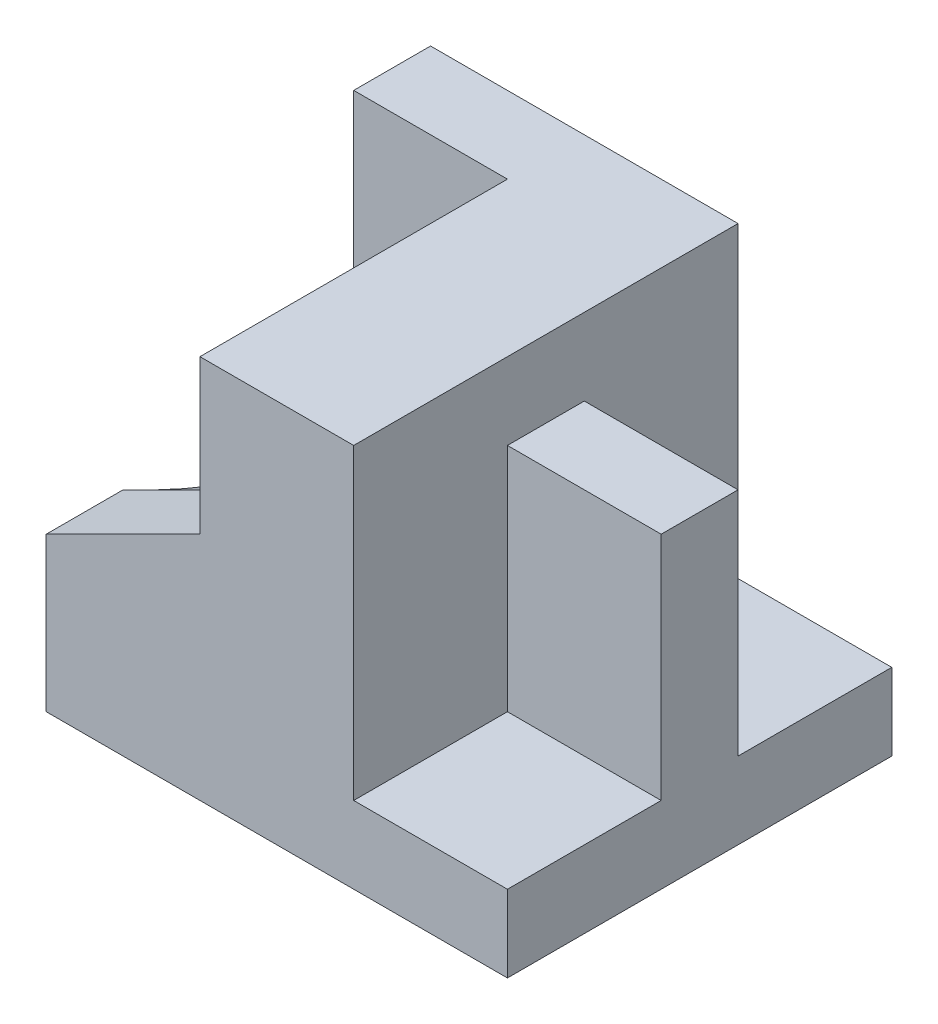
ISO-10303-21;
HEADER;
FILE_DESCRIPTION(('STEP AP214'),'2;1');
FILE_NAME('part.step','',(''),(''),'','','');
FILE_SCHEMA(('AUTOMOTIVE_DESIGN { 1 0 10303 214 1 1 1 1 }'));
ENDSEC;
DATA;
#1=APPLICATION_CONTEXT('core data for automotive mechanical design processes');
#2=APPLICATION_PROTOCOL_DEFINITION('international standard','automotive_design',2000,#1);
#3=PRODUCT_CONTEXT('',#1,'mechanical');
#4=PRODUCT('Part','Part','',(#3));
#5=PRODUCT_RELATED_PRODUCT_CATEGORY('part','',(#4));
#6=PRODUCT_DEFINITION_FORMATION('','',#4);
#7=PRODUCT_DEFINITION_CONTEXT('part definition',#1,'design');
#8=PRODUCT_DEFINITION('design','',#6,#7);
#9=PRODUCT_DEFINITION_SHAPE('','',#8);
#10=(LENGTH_UNIT() NAMED_UNIT(*) SI_UNIT(.MILLI.,.METRE.));
#11=(NAMED_UNIT(*) PLANE_ANGLE_UNIT() SI_UNIT($,.RADIAN.));
#12=(NAMED_UNIT(*) SI_UNIT($,.STERADIAN.) SOLID_ANGLE_UNIT());
#13=UNCERTAINTY_MEASURE_WITH_UNIT(LENGTH_MEASURE(1.E-05),#10,'distance_accuracy_value','');
#14=(GEOMETRIC_REPRESENTATION_CONTEXT(3) GLOBAL_UNCERTAINTY_ASSIGNED_CONTEXT((#13)) GLOBAL_UNIT_ASSIGNED_CONTEXT((#10,
#11,#12)) REPRESENTATION_CONTEXT('',''));
#15=CARTESIAN_POINT('',(0.,0.,0.));
#16=DIRECTION('',(0.,0.,1.));
#17=DIRECTION('',(1.,0.,0.));
#18=AXIS2_PLACEMENT_3D('',#15,#16,#17);
#19=CARTESIAN_POINT('',(0.,0.,5.));
#20=DIRECTION('',(1.,0.,0.));
#21=DIRECTION('',(0.,0.,-1.));
#22=AXIS2_PLACEMENT_3D('',#19,#20,#21);
#23=PLANE('',#22);
#24=DIRECTION('',(0.,-1.,0.));
#25=VECTOR('',#24,1.);
#26=CARTESIAN_POINT('',(0.,0.,0.));
#27=LINE('',#26,#25);
#28=CARTESIAN_POINT('',(0.,5.,0.));
#29=VERTEX_POINT('',#28);
#30=CARTESIAN_POINT('',(0.,2.,0.));
#31=VERTEX_POINT('',#30);
#32=EDGE_CURVE('E177',#29,#31,#27,.T.);
#33=ORIENTED_EDGE('',*,*,#32,.T.);
#34=DIRECTION('',(0.,0.,-1.));
#35=VECTOR('',#34,1.);
#36=CARTESIAN_POINT('',(0.,2.,1.));
#37=LINE('',#36,#35);
#38=CARTESIAN_POINT('',(0.,2.,1.));
#39=VERTEX_POINT('',#38);
#40=EDGE_CURVE('E160',#39,#31,#37,.T.);
#41=ORIENTED_EDGE('',*,*,#40,.F.);
#42=DIRECTION('',(0.,-1.,0.));
#43=VECTOR('',#42,1.);
#44=CARTESIAN_POINT('',(0.,2.,1.));
#45=LINE('',#44,#43);
#46=CARTESIAN_POINT('',(0.,5.,1.));
#47=VERTEX_POINT('',#46);
#48=EDGE_CURVE('E174',#47,#39,#45,.T.);
#49=ORIENTED_EDGE('',*,*,#48,.F.);
#50=DIRECTION('',(0.,0.,-1.));
#51=VECTOR('',#50,1.);
#52=CARTESIAN_POINT('',(0.,5.,5.));
#53=LINE('',#52,#51);
#54=EDGE_CURVE('E343',#47,#29,#53,.T.);
#55=ORIENTED_EDGE('',*,*,#54,.T.);
#56=EDGE_LOOP('',(#33,#41,#49,#55));
#57=FACE_BOUND('',#56,.T.);
#58=ADVANCED_FACE('F33',(#57),#23,.F.);
#59=CARTESIAN_POINT('',(-8.82665831429788E-05,8.82665831460915E-05,0.999970577805619));
#60=CARTESIAN_POINT('',(-0.000101937588320512,0.0834332712958881,1.12496302136524));
#61=CARTESIAN_POINT('',(-9.60468862115812E-05,0.166761725183931,1.24996650181784));
#62=CARTESIAN_POINT('',(-8.45630091349386E-05,0.33341893048885,1.49997336354986));
#63=CARTESIAN_POINT('',(-7.89698343306675E-05,0.416747681905865,1.62497674482919));
#64=CARTESIAN_POINT('',(-0.000107502432283673,0.583441168355846,1.87496466474125));
#65=CARTESIAN_POINT('',(-0.000141629338490875,0.666805904347806,1.99994920273447));
#66=CARTESIAN_POINT('',(-0.000143409269886747,0.833471687003284,2.24994461351013));
#67=CARTESIAN_POINT('',(-0.00011106823520953,0.916772738692616,2.37495548294104));
#68=CARTESIAN_POINT('',(1.80121534620936E-05,1.08331448522919,2.62500475012513));
#69=CARTESIAN_POINT('',(0.000114747000592731,1.16655518389235,2.7500431453396));
#70=CARTESIAN_POINT('',(0.000212192686174759,1.33313365491132,3.00008950229164));
#71=CARTESIAN_POINT('',(0.000212885339078868,1.41647144266354,3.12509745378361));
#72=CARTESIAN_POINT('',(-8.18753815301955E-05,1.58341738803668,3.37497597718887));
#73=CARTESIAN_POINT('',(-0.000377399278812647,1.66702560531696,3.49984650929762));
#74=CARTESIAN_POINT('',(-0.000457758704942043,1.83373148266239,3.7497579997012));
#75=CARTESIAN_POINT('',(-0.000243072301886972,1.91682954758419,3.87479868882282));
#76=CARTESIAN_POINT('',(0.000628780145328558,1.99937121985467,4.00020959338177));
#77=B_SPLINE_CURVE_WITH_KNOTS('',3,(#59,#60,#61,#62,#63,#64,#65,#66,#67,#68,#69,#70,#71,#72,#73,
#74,#75,#76),.UNSPECIFIED.,.F.,.F.,(4,2,2,2,2,2,2,2,4),(0.,0.450694474783414,0.901389197143531,
1.35209678081739,1.80276408722315,2.25339985515404,2.7041209506531,3.15494938013611,
3.60535554903179),.UNSPECIFIED.);
#78=CARTESIAN_POINT('',(3.3537945503183E-06,1.99999664620545,4.00083740614955));
#79=VERTEX_POINT('',#78);
#80=CARTESIAN_POINT('',(0.,7.91007507679635E-05,0.999876855696093));
#81=VERTEX_POINT('',#80);
#82=EDGE_CURVE('E233',#79,#81,#77,.F.);
#83=ORIENTED_EDGE('',*,*,#82,.T.);
#84=DIRECTION('',(0.,0.,-1.));
#85=VECTOR('',#84,1.);
#86=CARTESIAN_POINT('',(0.,0.,5.));
#87=LINE('',#86,#85);
#88=CARTESIAN_POINT('',(0.,0.,5.));
#89=VERTEX_POINT('',#88);
#90=EDGE_CURVE('E336',#89,#81,#87,.T.);
#91=ORIENTED_EDGE('',*,*,#90,.F.);
#92=DIRECTION('',(0.,-1.,0.));
#93=VECTOR('',#92,1.);
#94=CARTESIAN_POINT('',(0.,0.,5.));
#95=LINE('',#94,#93);
#96=CARTESIAN_POINT('',(0.,2.,5.));
#97=VERTEX_POINT('',#96);
#98=EDGE_CURVE('E344',#97,#89,#95,.T.);
#99=ORIENTED_EDGE('',*,*,#98,.F.);
#100=DIRECTION('',(0.,0.,1.));
#101=VECTOR('',#100,1.);
#102=CARTESIAN_POINT('',(0.,2.,1.));
#103=LINE('',#102,#101);
#104=EDGE_CURVE('E58',#79,#97,#103,.T.);
#105=ORIENTED_EDGE('',*,*,#104,.F.);
#106=EDGE_LOOP('',(#83,#91,#99,#105));
#107=FACE_BOUND('',#106,.T.);
#108=ADVANCED_FACE('F419',(#107),#23,.F.);
#109=CARTESIAN_POINT('',(2.,3.,1.));
#110=DIRECTION('',(0.447213595499958,-0.894427190999916,0.));
#111=DIRECTION('',(0.894427190999916,0.447213595499958,0.));
#112=AXIS2_PLACEMENT_3D('',#109,#110,#111);
#113=PLANE('',#112);
#114=CARTESIAN_POINT('',(0.000628780145328666,1.99937121985467,4.00020959338178));
#115=CARTESIAN_POINT('',(0.0417000563102606,2.02098923748298,3.99996906459382));
#116=CARTESIAN_POINT('',(0.0830019762130452,2.0421544972503,3.99985477574583));
#117=CARTESIAN_POINT('',(0.166025174200976,2.08406625085698,3.99976585249856));
#118=CARTESIAN_POINT('',(0.207747466759843,2.10481074489584,3.99979177521869));
#119=CARTESIAN_POINT('',(0.333077489307124,2.16694351698843,3.99991005059225));
#120=CARTESIAN_POINT('',(0.416756693550908,2.20818510582847,4.00004294243267));
#121=CARTESIAN_POINT('',(0.583743103298787,2.29116153071518,4.00015778242983));
#122=CARTESIAN_POINT('',(0.667050639423958,2.33289569888574,4.00013991573917));
#123=CARTESIAN_POINT('',(0.833603211864982,2.41639508607089,4.00009033774703));
#124=CARTESIAN_POINT('',(0.91684825952239,2.45816028315872,4.00005863257833));
#125=CARTESIAN_POINT('',(1.08339476306728,2.54162400457967,4.00001630598977));
#126=CARTESIAN_POINT('',(1.16669622730561,2.58332251235105,4.00000568917817));
#127=CARTESIAN_POINT('',(1.33335611844586,2.66665469971677,4.00000519100137));
#128=CARTESIAN_POINT('',(1.41671455416019,2.70828836164714,4.00001531454066));
#129=CARTESIAN_POINT('',(1.58341401112963,2.79157173018227,4.00003006119613));
#130=CARTESIAN_POINT('',(1.66675503327861,2.83322143498822,4.00003468481136));
#131=CARTESIAN_POINT('',(1.83332749856729,2.91663047258542,4.00000739482183));
#132=CARTESIAN_POINT('',(1.91655897625153,2.95838973643643,3.99997550037541));
#133=CARTESIAN_POINT('',(1.99972956348556,3.00027043651445,3.99990985449519));
#134=B_SPLINE_CURVE_WITH_KNOTS('',3,(#114,#115,#116,#117,#118,#119,#120,#121,#122,#123,#124,
#125,#126,#127,#128,#129,#130,#131,#132,#133),.UNSPECIFIED.,.F.,.F.,(4,2,2,2,2,2,2,2,2,4),(0.,
0.139228521061579,0.279010660861323,0.558882590274114,0.838410847842227,1.1178153526661,
1.39728090669166,1.67681255376446,1.95631883469239,2.23567854646036),.UNSPECIFIED.);
#135=CARTESIAN_POINT('',(1.99994059453653,3.00005940546347,3.99996710504583));
#136=VERTEX_POINT('',#135);
#137=EDGE_CURVE('E50',#136,#79,#134,.F.);
#138=ORIENTED_EDGE('',*,*,#137,.T.);
#139=ORIENTED_EDGE('',*,*,#104,.T.);
#140=DIRECTION('',(0.894427190999916,0.447213595499958,0.));
#141=VECTOR('',#140,1.);
#142=CARTESIAN_POINT('',(2.,3.,5.));
#143=LINE('',#142,#141);
#144=CARTESIAN_POINT('',(2.,3.,5.));
#145=VERTEX_POINT('',#144);
#146=EDGE_CURVE('E231',#97,#145,#143,.T.);
#147=ORIENTED_EDGE('',*,*,#146,.T.);
#148=DIRECTION('',(0.,0.,1.));
#149=VECTOR('',#148,1.);
#150=CARTESIAN_POINT('',(2.,3.,1.));
#151=LINE('',#150,#149);
#152=EDGE_CURVE('E329',#136,#145,#151,.T.);
#153=ORIENTED_EDGE('',*,*,#152,.F.);
#154=EDGE_LOOP('',(#138,#139,#147,#153));
#155=FACE_BOUND('',#154,.T.);
#156=ADVANCED_FACE('F207',(#155),#113,.F.);
#157=CARTESIAN_POINT('',(6.,0.,5.));
#158=DIRECTION('',(0.,1.,0.));
#159=DIRECTION('',(-1.,0.,0.));
#160=AXIS2_PLACEMENT_3D('',#157,#158,#159);
#161=PLANE('',#160);
#162=DIRECTION('',(-1.,0.,0.));
#163=VECTOR('',#162,1.);
#164=CARTESIAN_POINT('',(2.,0.,1.));
#165=LINE('',#164,#163);
#166=CARTESIAN_POINT('',(2.,0.,1.));
#167=VERTEX_POINT('',#166);
#168=EDGE_CURVE('E178',#167,#81,#165,.T.);
#169=ORIENTED_EDGE('',*,*,#168,.F.);
#170=DIRECTION('',(0.,0.,-1.));
#171=VECTOR('',#170,1.);
#172=CARTESIAN_POINT('',(2.,0.,1.));
#173=LINE('',#172,#171);
#174=CARTESIAN_POINT('',(2.,0.,0.));
#175=VERTEX_POINT('',#174);
#176=EDGE_CURVE('E241',#167,#175,#173,.T.);
#177=ORIENTED_EDGE('',*,*,#176,.T.);
#178=DIRECTION('',(1.,0.,0.));
#179=VECTOR('',#178,1.);
#180=CARTESIAN_POINT('',(6.,0.,0.));
#181=LINE('',#180,#179);
#182=CARTESIAN_POINT('',(6.,0.,0.));
#183=VERTEX_POINT('',#182);
#184=EDGE_CURVE('E376',#175,#183,#181,.T.);
#185=ORIENTED_EDGE('',*,*,#184,.T.);
#186=DIRECTION('',(0.,0.,-1.));
#187=VECTOR('',#186,1.);
#188=CARTESIAN_POINT('',(6.,0.,5.));
#189=LINE('',#188,#187);
#190=CARTESIAN_POINT('',(6.,0.,5.));
#191=VERTEX_POINT('',#190);
#192=EDGE_CURVE('E11',#191,#183,#189,.T.);
#193=ORIENTED_EDGE('',*,*,#192,.F.);
#194=DIRECTION('',(1.,0.,0.));
#195=VECTOR('',#194,1.);
#196=CARTESIAN_POINT('',(6.,0.,5.));
#197=LINE('',#196,#195);
#198=EDGE_CURVE('E388',#89,#191,#197,.T.);
#199=ORIENTED_EDGE('',*,*,#198,.F.);
#200=ORIENTED_EDGE('',*,*,#90,.T.);
#201=EDGE_LOOP('',(#169,#177,#185,#193,#199,#200));
#202=FACE_BOUND('',#201,.T.);
#203=ADVANCED_FACE('F35',(#202),#161,.F.);
#204=CARTESIAN_POINT('',(6.,4.,5.));
#205=DIRECTION('',(-1.,0.,0.));
#206=DIRECTION('',(0.,-1.,0.));
#207=AXIS2_PLACEMENT_3D('',#204,#205,#206);
#208=PLANE('',#207);
#209=DIRECTION('',(0.,0.,-1.));
#210=VECTOR('',#209,1.);
#211=CARTESIAN_POINT('',(6.,4.,5.));
#212=LINE('',#211,#210);
#213=CARTESIAN_POINT('',(6.,4.,3.));
#214=VERTEX_POINT('',#213);
#215=CARTESIAN_POINT('',(6.,4.,2.));
#216=VERTEX_POINT('',#215);
#217=EDGE_CURVE('E42',#214,#216,#212,.T.);
#218=ORIENTED_EDGE('',*,*,#217,.F.);
#219=DIRECTION('',(0.,1.,0.));
#220=VECTOR('',#219,1.);
#221=CARTESIAN_POINT('',(6.,1.,3.));
#222=LINE('',#221,#220);
#223=CARTESIAN_POINT('',(6.,1.,3.));
#224=VERTEX_POINT('',#223);
#225=EDGE_CURVE('E438',#224,#214,#222,.T.);
#226=ORIENTED_EDGE('',*,*,#225,.F.);
#227=DIRECTION('',(0.,0.,-1.));
#228=VECTOR('',#227,1.);
#229=CARTESIAN_POINT('',(6.,1.,5.));
#230=LINE('',#229,#228);
#231=CARTESIAN_POINT('',(6.,1.,5.));
#232=VERTEX_POINT('',#231);
#233=EDGE_CURVE('E323',#232,#224,#230,.T.);
#234=ORIENTED_EDGE('',*,*,#233,.F.);
#235=DIRECTION('',(0.,1.,0.));
#236=VECTOR('',#235,1.);
#237=CARTESIAN_POINT('',(6.,4.,5.));
#238=LINE('',#237,#236);
#239=EDGE_CURVE('E391',#191,#232,#238,.T.);
#240=ORIENTED_EDGE('',*,*,#239,.F.);
#241=ORIENTED_EDGE('',*,*,#192,.T.);
#242=DIRECTION('',(0.,1.,0.));
#243=VECTOR('',#242,1.);
#244=CARTESIAN_POINT('',(6.,4.,0.));
#245=LINE('',#244,#243);
#246=CARTESIAN_POINT('',(6.,1.,0.));
#247=VERTEX_POINT('',#246);
#248=EDGE_CURVE('E401',#183,#247,#245,.T.);
#249=ORIENTED_EDGE('',*,*,#248,.T.);
#250=DIRECTION('',(0.,0.,-1.));
#251=VECTOR('',#250,1.);
#252=CARTESIAN_POINT('',(6.,1.,0.));
#253=LINE('',#252,#251);
#254=CARTESIAN_POINT('',(6.,1.,2.));
#255=VERTEX_POINT('',#254);
#256=EDGE_CURVE('E381',#255,#247,#253,.T.);
#257=ORIENTED_EDGE('',*,*,#256,.F.);
#258=DIRECTION('',(0.,1.,0.));
#259=VECTOR('',#258,1.);
#260=CARTESIAN_POINT('',(6.,1.,2.));
#261=LINE('',#260,#259);
#262=EDGE_CURVE('E373',#255,#216,#261,.T.);
#263=ORIENTED_EDGE('',*,*,#262,.T.);
#264=EDGE_LOOP('',(#218,#226,#234,#240,#241,#249,#257,#263));
#265=FACE_BOUND('',#264,.T.);
#266=ADVANCED_FACE('F379',(#265),#208,.F.);
#267=CARTESIAN_POINT('',(4.,4.,5.));
#268=DIRECTION('',(0.,-1.,0.));
#269=DIRECTION('',(0.,0.,-1.));
#270=AXIS2_PLACEMENT_3D('',#267,#268,#269);
#271=PLANE('',#270);
#272=DIRECTION('',(0.,0.,-1.));
#273=VECTOR('',#272,1.);
#274=CARTESIAN_POINT('',(4.,4.,5.));
#275=LINE('',#274,#273);
#276=CARTESIAN_POINT('',(4.,4.,3.));
#277=VERTEX_POINT('',#276);
#278=CARTESIAN_POINT('',(4.,4.,2.));
#279=VERTEX_POINT('',#278);
#280=EDGE_CURVE('E353',#277,#279,#275,.T.);
#281=ORIENTED_EDGE('',*,*,#280,.F.);
#282=DIRECTION('',(1.,0.,0.));
#283=VECTOR('',#282,1.);
#284=CARTESIAN_POINT('',(4.,4.,3.));
#285=LINE('',#284,#283);
#286=EDGE_CURVE('E365',#277,#214,#285,.T.);
#287=ORIENTED_EDGE('',*,*,#286,.T.);
#288=ORIENTED_EDGE('',*,*,#217,.T.);
#289=DIRECTION('',(-1.,0.,0.));
#290=VECTOR('',#289,1.);
#291=CARTESIAN_POINT('',(4.,4.,2.));
#292=LINE('',#291,#290);
#293=EDGE_CURVE('E364',#216,#279,#292,.T.);
#294=ORIENTED_EDGE('',*,*,#293,.T.);
#295=EDGE_LOOP('',(#281,#287,#288,#294));
#296=FACE_BOUND('',#295,.T.);
#297=ADVANCED_FACE('F363',(#296),#271,.F.);
#298=CARTESIAN_POINT('',(4.,5.,5.));
#299=DIRECTION('',(-1.,0.,0.));
#300=DIRECTION('',(0.,-1.,0.));
#301=AXIS2_PLACEMENT_3D('',#298,#299,#300);
#302=PLANE('',#301);
#303=DIRECTION('',(0.,1.,0.));
#304=VECTOR('',#303,1.);
#305=CARTESIAN_POINT('',(4.,5.,0.));
#306=LINE('',#305,#304);
#307=CARTESIAN_POINT('',(4.,1.,0.));
#308=VERTEX_POINT('',#307);
#309=CARTESIAN_POINT('',(4.,5.,0.));
#310=VERTEX_POINT('',#309);
#311=EDGE_CURVE('E403',#308,#310,#306,.T.);
#312=ORIENTED_EDGE('',*,*,#311,.T.);
#313=DIRECTION('',(0.,0.,-1.));
#314=VECTOR('',#313,1.);
#315=CARTESIAN_POINT('',(4.,5.,5.));
#316=LINE('',#315,#314);
#317=CARTESIAN_POINT('',(4.,5.,5.));
#318=VERTEX_POINT('',#317);
#319=EDGE_CURVE('E351',#318,#310,#316,.T.);
#320=ORIENTED_EDGE('',*,*,#319,.F.);
#321=DIRECTION('',(0.,1.,0.));
#322=VECTOR('',#321,1.);
#323=CARTESIAN_POINT('',(4.,5.,5.));
#324=LINE('',#323,#322);
#325=CARTESIAN_POINT('',(4.,1.,5.));
#326=VERTEX_POINT('',#325);
#327=EDGE_CURVE('E394',#326,#318,#324,.T.);
#328=ORIENTED_EDGE('',*,*,#327,.F.);
#329=DIRECTION('',(0.,0.,1.));
#330=VECTOR('',#329,1.);
#331=CARTESIAN_POINT('',(4.,1.,5.));
#332=LINE('',#331,#330);
#333=CARTESIAN_POINT('',(4.,1.,3.));
#334=VERTEX_POINT('',#333);
#335=EDGE_CURVE('E442',#334,#326,#332,.T.);
#336=ORIENTED_EDGE('',*,*,#335,.F.);
#337=DIRECTION('',(0.,1.,0.));
#338=VECTOR('',#337,1.);
#339=CARTESIAN_POINT('',(4.,1.,3.));
#340=LINE('',#339,#338);
#341=EDGE_CURVE('E446',#334,#277,#340,.T.);
#342=ORIENTED_EDGE('',*,*,#341,.T.);
#343=ORIENTED_EDGE('',*,*,#280,.T.);
#344=DIRECTION('',(0.,1.,0.));
#345=VECTOR('',#344,1.);
#346=CARTESIAN_POINT('',(4.,1.,2.));
#347=LINE('',#346,#345);
#348=CARTESIAN_POINT('',(4.,1.,2.));
#349=VERTEX_POINT('',#348);
#350=EDGE_CURVE('E375',#349,#279,#347,.T.);
#351=ORIENTED_EDGE('',*,*,#350,.F.);
#352=DIRECTION('',(0.,0.,1.));
#353=VECTOR('',#352,1.);
#354=CARTESIAN_POINT('',(4.,1.,0.));
#355=LINE('',#354,#353);
#356=EDGE_CURVE('E431',#308,#349,#355,.T.);
#357=ORIENTED_EDGE('',*,*,#356,.F.);
#358=EDGE_LOOP('',(#312,#320,#328,#336,#342,#343,#351,#357));
#359=FACE_BOUND('',#358,.T.);
#360=ADVANCED_FACE('F428',(#359),#302,.F.);
#361=CARTESIAN_POINT('',(0.,5.,5.));
#362=DIRECTION('',(0.,-1.,0.));
#363=DIRECTION('',(0.,0.,-1.));
#364=AXIS2_PLACEMENT_3D('',#361,#362,#363);
#365=PLANE('',#364);
#366=DIRECTION('',(-1.,0.,0.));
#367=VECTOR('',#366,1.);
#368=CARTESIAN_POINT('',(0.,5.,1.));
#369=LINE('',#368,#367);
#370=CARTESIAN_POINT('',(2.,5.,1.));
#371=VERTEX_POINT('',#370);
#372=EDGE_CURVE('E182',#371,#47,#369,.T.);
#373=ORIENTED_EDGE('',*,*,#372,.F.);
#374=DIRECTION('',(0.,0.,1.));
#375=VECTOR('',#374,1.);
#376=CARTESIAN_POINT('',(2.,5.,1.));
#377=LINE('',#376,#375);
#378=CARTESIAN_POINT('',(2.,5.,5.));
#379=VERTEX_POINT('',#378);
#380=EDGE_CURVE('E320',#371,#379,#377,.T.);
#381=ORIENTED_EDGE('',*,*,#380,.T.);
#382=DIRECTION('',(-1.,0.,0.));
#383=VECTOR('',#382,1.);
#384=CARTESIAN_POINT('',(0.,5.,5.));
#385=LINE('',#384,#383);
#386=EDGE_CURVE('E396',#318,#379,#385,.T.);
#387=ORIENTED_EDGE('',*,*,#386,.F.);
#388=ORIENTED_EDGE('',*,*,#319,.T.);
#389=DIRECTION('',(-1.,0.,0.));
#390=VECTOR('',#389,1.);
#391=CARTESIAN_POINT('',(0.,5.,0.));
#392=LINE('',#391,#390);
#393=EDGE_CURVE('E405',#310,#29,#392,.T.);
#394=ORIENTED_EDGE('',*,*,#393,.T.);
#395=ORIENTED_EDGE('',*,*,#54,.F.);
#396=EDGE_LOOP('',(#373,#381,#387,#388,#394,#395));
#397=FACE_BOUND('',#396,.T.);
#398=ADVANCED_FACE('F409',(#397),#365,.F.);
#399=CARTESIAN_POINT('',(0.,0.,5.));
#400=DIRECTION('',(0.,0.,-1.));
#401=DIRECTION('',(-1.,0.,0.));
#402=AXIS2_PLACEMENT_3D('',#399,#400,#401);
#403=PLANE('',#402);
#404=ORIENTED_EDGE('',*,*,#386,.T.);
#405=DIRECTION('',(0.,1.,0.));
#406=VECTOR('',#405,1.);
#407=CARTESIAN_POINT('',(2.,5.,5.));
#408=LINE('',#407,#406);
#409=EDGE_CURVE('E185',#145,#379,#408,.T.);
#410=ORIENTED_EDGE('',*,*,#409,.F.);
#411=ORIENTED_EDGE('',*,*,#146,.F.);
#412=ORIENTED_EDGE('',*,*,#98,.T.);
#413=ORIENTED_EDGE('',*,*,#198,.T.);
#414=ORIENTED_EDGE('',*,*,#239,.T.);
#415=DIRECTION('',(1.,0.,0.));
#416=VECTOR('',#415,1.);
#417=CARTESIAN_POINT('',(6.,1.,5.));
#418=LINE('',#417,#416);
#419=EDGE_CURVE('E424',#326,#232,#418,.T.);
#420=ORIENTED_EDGE('',*,*,#419,.F.);
#421=ORIENTED_EDGE('',*,*,#327,.T.);
#422=EDGE_LOOP('',(#404,#410,#411,#412,#413,#414,#420,#421));
#423=FACE_BOUND('',#422,.T.);
#424=ADVANCED_FACE('F421',(#423),#403,.F.);
#425=CARTESIAN_POINT('',(0.,0.,0.));
#426=DIRECTION('',(0.,0.,-1.));
#427=DIRECTION('',(-1.,0.,0.));
#428=AXIS2_PLACEMENT_3D('',#425,#426,#427);
#429=PLANE('',#428);
#430=DIRECTION('',(0.,-1.,0.));
#431=VECTOR('',#430,1.);
#432=CARTESIAN_POINT('',(2.,3.,0.));
#433=LINE('',#432,#431);
#434=CARTESIAN_POINT('',(2.,3.,0.));
#435=VERTEX_POINT('',#434);
#436=EDGE_CURVE('E169',#435,#175,#433,.T.);
#437=ORIENTED_EDGE('',*,*,#436,.F.);
#438=DIRECTION('',(0.894427190999916,0.447213595499958,0.));
#439=VECTOR('',#438,1.);
#440=CARTESIAN_POINT('',(0.,2.,0.));
#441=LINE('',#440,#439);
#442=EDGE_CURVE('E415',#31,#435,#441,.T.);
#443=ORIENTED_EDGE('',*,*,#442,.F.);
#444=ORIENTED_EDGE('',*,*,#32,.F.);
#445=ORIENTED_EDGE('',*,*,#393,.F.);
#446=ORIENTED_EDGE('',*,*,#311,.F.);
#447=DIRECTION('',(-1.,0.,0.));
#448=VECTOR('',#447,1.);
#449=CARTESIAN_POINT('',(4.,1.,0.));
#450=LINE('',#449,#448);
#451=EDGE_CURVE('E383',#247,#308,#450,.T.);
#452=ORIENTED_EDGE('',*,*,#451,.F.);
#453=ORIENTED_EDGE('',*,*,#248,.F.);
#454=ORIENTED_EDGE('',*,*,#184,.F.);
#455=EDGE_LOOP('',(#437,#443,#444,#445,#446,#452,#453,#454));
#456=FACE_BOUND('',#455,.T.);
#457=ADVANCED_FACE('F414',(#456),#429,.T.);
#458=CARTESIAN_POINT('',(4.,1.,2.));
#459=DIRECTION('',(0.,0.,1.));
#460=DIRECTION('',(1.,0.,0.));
#461=AXIS2_PLACEMENT_3D('',#458,#459,#460);
#462=PLANE('',#461);
#463=ORIENTED_EDGE('',*,*,#262,.F.);
#464=DIRECTION('',(1.,0.,0.));
#465=VECTOR('',#464,1.);
#466=CARTESIAN_POINT('',(4.,1.,2.));
#467=LINE('',#466,#465);
#468=EDGE_CURVE('E452',#349,#255,#467,.T.);
#469=ORIENTED_EDGE('',*,*,#468,.F.);
#470=ORIENTED_EDGE('',*,*,#350,.T.);
#471=ORIENTED_EDGE('',*,*,#293,.F.);
#472=EDGE_LOOP('',(#463,#469,#470,#471));
#473=FACE_BOUND('',#472,.T.);
#474=ADVANCED_FACE('F371',(#473),#462,.F.);
#475=CARTESIAN_POINT('',(0.,1.,0.));
#476=DIRECTION('',(0.,1.,0.));
#477=DIRECTION('',(0.,0.,1.));
#478=AXIS2_PLACEMENT_3D('',#475,#476,#477);
#479=PLANE('',#478);
#480=ORIENTED_EDGE('',*,*,#356,.T.);
#481=ORIENTED_EDGE('',*,*,#468,.T.);
#482=ORIENTED_EDGE('',*,*,#256,.T.);
#483=ORIENTED_EDGE('',*,*,#451,.T.);
#484=EDGE_LOOP('',(#480,#481,#482,#483));
#485=FACE_BOUND('',#484,.T.);
#486=ADVANCED_FACE('F453',(#485),#479,.T.);
#487=CARTESIAN_POINT('',(6.,1.,3.));
#488=DIRECTION('',(0.,0.,-1.));
#489=DIRECTION('',(-1.,0.,0.));
#490=AXIS2_PLACEMENT_3D('',#487,#488,#489);
#491=PLANE('',#490);
#492=ORIENTED_EDGE('',*,*,#341,.F.);
#493=DIRECTION('',(-1.,0.,0.));
#494=VECTOR('',#493,1.);
#495=CARTESIAN_POINT('',(6.,1.,3.));
#496=LINE('',#495,#494);
#497=EDGE_CURVE('E441',#224,#334,#496,.T.);
#498=ORIENTED_EDGE('',*,*,#497,.F.);
#499=ORIENTED_EDGE('',*,*,#225,.T.);
#500=ORIENTED_EDGE('',*,*,#286,.F.);
#501=EDGE_LOOP('',(#492,#498,#499,#500));
#502=FACE_BOUND('',#501,.T.);
#503=ADVANCED_FACE('F455',(#502),#491,.F.);
#504=CARTESIAN_POINT('',(0.,1.,0.));
#505=DIRECTION('',(0.,1.,0.));
#506=DIRECTION('',(0.,0.,1.));
#507=AXIS2_PLACEMENT_3D('',#504,#505,#506);
#508=PLANE('',#507);
#509=ORIENTED_EDGE('',*,*,#233,.T.);
#510=ORIENTED_EDGE('',*,*,#497,.T.);
#511=ORIENTED_EDGE('',*,*,#335,.T.);
#512=ORIENTED_EDGE('',*,*,#419,.T.);
#513=EDGE_LOOP('',(#509,#510,#511,#512));
#514=FACE_BOUND('',#513,.T.);
#515=ADVANCED_FACE('F204',(#514),#508,.T.);
#516=CARTESIAN_POINT('',(2.,5.,1.));
#517=DIRECTION('',(1.,0.,0.));
#518=DIRECTION('',(0.,1.,0.));
#519=AXIS2_PLACEMENT_3D('',#516,#517,#518);
#520=PLANE('',#519);
#521=ORIENTED_EDGE('',*,*,#409,.T.);
#522=ORIENTED_EDGE('',*,*,#380,.F.);
#523=DIRECTION('',(0.,1.,0.));
#524=VECTOR('',#523,1.);
#525=CARTESIAN_POINT('',(2.,5.,1.));
#526=LINE('',#525,#524);
#527=CARTESIAN_POINT('',(2.,2.99985546037826,1.));
#528=VERTEX_POINT('',#527);
#529=EDGE_CURVE('E183',#528,#371,#526,.T.);
#530=ORIENTED_EDGE('',*,*,#529,.F.);
#531=CARTESIAN_POINT('',(2.,3.,1.09927974462226));
#532=CARTESIAN_POINT('',(2.00000328308013,2.99999671691988,1.09514424059151));
#533=CARTESIAN_POINT('',(2.00000673727192,2.99999326272809,1.09100873682945));
#534=CARTESIAN_POINT('',(2.00001400365029,2.99998599634971,1.08273784863344));
#535=CARTESIAN_POINT('',(2.0000178158266,2.9999821841734,1.07860246419948));
#536=CARTESIAN_POINT('',(2.00002581401228,2.99997418598772,1.07033181996212));
#537=CARTESIAN_POINT('',(2.00003000001045,2.99996999998955,1.06619656015869));
#538=CARTESIAN_POINT('',(2.00003876212878,2.99996123787122,1.05792617060548));
#539=CARTESIAN_POINT('',(2.00004333823675,2.99995666176326,1.05379104085566));
#540=CARTESIAN_POINT('',(2.00005289719419,2.99994710280581,1.04552091695134));
#541=CARTESIAN_POINT('',(2.00005788003042,2.99994211996958,1.04138592279682));
#542=CARTESIAN_POINT('',(2.00006826943942,2.99993173056058,1.03311607574565));
#543=CARTESIAN_POINT('',(2.00007367599782,2.99992632400219,1.02898122284898));
#544=CARTESIAN_POINT('',(2.00008493018193,2.99991506981807,1.02071166409663));
#545=CARTESIAN_POINT('',(2.00009077779209,2.99990922220792,1.01657695824092));
#546=CARTESIAN_POINT('',(2.00010293188025,2.99989706811975,1.00830769947978));
#547=CARTESIAN_POINT('',(2.00010923834142,2.99989076165858,1.0041731465743));
#548=CARTESIAN_POINT('',(2.00011578325812,2.99988421674188,1.00003859441937));
#549=B_SPLINE_CURVE_WITH_KNOTS('',3,(#531,#532,#533,#534,#535,#536,#537,#538,#539,#540,#541,
#542,#543,#544,#545,#546,#547,#548),.UNSPECIFIED.,.F.,.F.,(4,2,2,2,2,2,2,2,4),(0.,
0.0124065199086682,0.0248126837217374,0.0372184758085529,0.0496238802120372,0.0620288806473459,
0.0744334605006277,0.0868376028278728,0.0992412903538751),.UNSPECIFIED.);
#550=CARTESIAN_POINT('',(2.,3.,1.09927974462226));
#551=VERTEX_POINT('',#550);
#552=EDGE_CURVE('E229',#528,#551,#549,.F.);
#553=ORIENTED_EDGE('',*,*,#552,.T.);
#554=CARTESIAN_POINT('',(2.,3.,3.89640027098979));
#555=CARTESIAN_POINT('',(2.00019307359029,2.99980692640972,3.77987399354386));
#556=CARTESIAN_POINT('',(2.00022183185459,2.99977816814542,3.66334775133825));
#557=CARTESIAN_POINT('',(2.00014601405917,2.99985398594084,3.43025081762427));
#558=CARTESIAN_POINT('',(2.00004138712045,2.99995861287955,3.31368012612058));
#559=CARTESIAN_POINT('',(1.999894252719,3.000105747281,3.08054924018202));
#560=CARTESIAN_POINT('',(1.9998517396388,3.0001482603612,2.96398904575131));
#561=CARTESIAN_POINT('',(1.99984089538888,3.00015910461113,2.73088999026415));
#562=CARTESIAN_POINT('',(1.99987255063663,3.00012744936338,2.61435112920967));
#563=CARTESIAN_POINT('',(1.99996110783451,3.0000388921655,2.3812809556891));
#564=CARTESIAN_POINT('',(2.00001800815638,2.99998199184363,2.26474964322088));
#565=CARTESIAN_POINT('',(2.00009220611619,2.99990779388381,2.03167561395822));
#566=CARTESIAN_POINT('',(2.00010949989169,2.99989050010831,1.91513289715983));
#567=CARTESIAN_POINT('',(2.00007240438266,2.99992759561734,1.68203162289458));
#568=CARTESIAN_POINT('',(2.00001800533774,2.99998199466226,1.56547306543143));
#569=CARTESIAN_POINT('',(1.99995015199013,3.00004984800988,1.33236959495129));
#570=CARTESIAN_POINT('',(1.99993669289141,3.00006330710859,1.21582468193556));
#571=CARTESIAN_POINT('',(2.,3.,1.09927974462226));
#572=B_SPLINE_CURVE_WITH_KNOTS('',3,(#554,#555,#556,#557,#558,#559,#560,#561,#562,#563,#564,
#565,#566,#567,#568,#569,#570,#571),.UNSPECIFIED.,.F.,.F.,(4,2,2,2,2,2,2,2,4),(0.,
0.349578852507868,0.699291089721743,1.04897169759223,1.39858827306129,1.7481823019942,
2.09781042210829,2.44748614614501,2.79712090489165),.UNSPECIFIED.);
#573=CARTESIAN_POINT('',(2.,3.,3.89640027098978));
#574=VERTEX_POINT('',#573);
#575=EDGE_CURVE('E226',#551,#574,#572,.F.);
#576=ORIENTED_EDGE('',*,*,#575,.T.);
#577=CARTESIAN_POINT('',(1.99972956348556,3.00027043651445,3.99990985449519));
#578=CARTESIAN_POINT('',(1.99974393768375,3.00025606231626,3.99559785344904));
#579=CARTESIAN_POINT('',(1.99975788794922,3.00024211205078,3.99128584958791));
#580=CARTESIAN_POINT('',(1.99978496854232,3.00021503145768,3.9826615685366));
#581=CARTESIAN_POINT('',(1.99979809881889,3.00020190118111,3.97834929134611));
#582=CARTESIAN_POINT('',(1.99982356634743,3.00017643365257,3.96972447257911));
#583=CARTESIAN_POINT('',(1.99983590355159,3.00016409644841,3.96541193100232));
#584=CARTESIAN_POINT('',(1.99985981121636,3.00014018878364,3.95678659223198));
#585=CARTESIAN_POINT('',(1.99987138163225,3.00012861836776,3.95247379503818));
#586=CARTESIAN_POINT('',(1.99989378155147,3.00010621844854,3.94384795364243));
#587=CARTESIAN_POINT('',(1.999904611013,3.00009538898701,3.93953490944026));
#588=CARTESIAN_POINT('',(1.99992555434981,3.0000744456502,3.9309085824734));
#589=CARTESIAN_POINT('',(1.99993566818605,3.00006433181395,3.92659529970851));
#590=CARTESIAN_POINT('',(1.99995520515472,3.00004479484529,3.91796850390329));
#591=CARTESIAN_POINT('',(1.99996462825074,3.00003537174927,3.91365499086279));
#592=CARTESIAN_POINT('',(1.99998280801321,3.00001719198679,3.90502774262764));
#593=CARTESIAN_POINT('',(1.99999156464576,3.00000843535425,3.90071400743284));
#594=CARTESIAN_POINT('',(2.,3.,3.89640027098979));
#595=B_SPLINE_CURVE_WITH_KNOTS('',3,(#577,#578,#579,#580,#581,#582,#583,#584,#585,#586,#587,
#588,#589,#590,#591,#592,#593,#594),.UNSPECIFIED.,.F.,.F.,(4,2,2,2,2,2,2,2,4),(0.,
0.0129361468298692,0.025873098185951,0.0388108286573464,0.0517493132298623,0.0646885272870907,
0.0776284466112538,0.0905690473838777,0.103510306186252),.UNSPECIFIED.);
#596=EDGE_CURVE('E227',#574,#136,#595,.F.);
#597=ORIENTED_EDGE('',*,*,#596,.T.);
#598=ORIENTED_EDGE('',*,*,#152,.T.);
#599=EDGE_LOOP('',(#521,#522,#530,#553,#576,#597,#598));
#600=FACE_BOUND('',#599,.T.);
#601=ADVANCED_FACE('F194',(#600),#520,.F.);
#602=CARTESIAN_POINT('',(0.,0.,1.));
#603=DIRECTION('',(0.,0.,-1.));
#604=DIRECTION('',(-1.,0.,0.));
#605=AXIS2_PLACEMENT_3D('',#602,#603,#604);
#606=PLANE('',#605);
#607=ORIENTED_EDGE('',*,*,#48,.T.);
#608=DIRECTION('',(0.894427190999916,0.447213595499958,0.));
#609=VECTOR('',#608,1.);
#610=CARTESIAN_POINT('',(0.,2.,1.));
#611=LINE('',#610,#609);
#612=EDGE_CURVE('E156',#39,#528,#611,.T.);
#613=ORIENTED_EDGE('',*,*,#612,.T.);
#614=ORIENTED_EDGE('',*,*,#529,.T.);
#615=ORIENTED_EDGE('',*,*,#372,.T.);
#616=EDGE_LOOP('',(#607,#613,#614,#615));
#617=FACE_BOUND('',#616,.T.);
#618=ADVANCED_FACE('F180',(#617),#606,.F.);
#619=CARTESIAN_POINT('',(2.02000751960194,3.02995226873288,0.797810397926125));
#620=CARTESIAN_POINT('',(1.85809534278088,2.77366723020555,0.81358310226496));
#621=CARTESIAN_POINT('',(1.69566983046544,2.51789552717259,0.829184694772334));
#622=CARTESIAN_POINT('',(1.53171802426957,2.26365011802007,0.844277522652895));
#623=CARTESIAN_POINT('',(1.29047736446447,1.89476490463691,0.865615653836585));
#624=CARTESIAN_POINT('',(1.04713750611528,1.52797888979785,0.886254052172243));
#625=CARTESIAN_POINT('',(0.970375722163247,1.41281201591001,0.892675045361102));
#626=CARTESIAN_POINT('',(0.729250100826861,1.05214163553095,0.912662336484094));
#627=CARTESIAN_POINT('',(0.486593513489677,0.693002221152692,0.932139305606821));
#628=CARTESIAN_POINT('',(0.320856833867277,0.448871556899506,0.945247989461609));
#629=CARTESIAN_POINT('',(0.154502168143008,0.205358878748192,0.958150677949107));
#630=CARTESIAN_POINT('',(-0.0122926971421414,-0.0377135998422361,0.970906633249643));
#631=CARTESIAN_POINT('',(2.0195084313871,3.03058659836529,1.47766430450952));
#632=CARTESIAN_POINT('',(1.83893231550006,2.79296549890393,1.48721569582637));
#633=CARTESIAN_POINT('',(1.65801969685739,2.5556809021982,1.496654919558));
#634=CARTESIAN_POINT('',(1.47753139176417,2.31797199194302,1.50623558113945));
#635=CARTESIAN_POINT('',(1.21378227802735,1.97159523249159,1.5200708943459));
#636=CARTESIAN_POINT('',(0.950956128913392,1.62429550841728,1.53421386242664));
#637=CARTESIAN_POINT('',(0.868613628391549,1.51470935109926,1.53877461675889));
#638=CARTESIAN_POINT('',(0.609840321904145,1.17168665587121,1.55287934616488));
#639=CARTESIAN_POINT('',(0.351920185868068,0.82781079019184,1.56726846572131));
#640=CARTESIAN_POINT('',(0.174745603295714,0.595118028888608,1.57656451525944));
#641=CARTESIAN_POINT('',(-0.00185306735322979,0.36184935566197,1.58605253543872));
#642=CARTESIAN_POINT('',(-0.179140262157779,0.129269206590938,1.59531104756612));
#643=CARTESIAN_POINT('',(2.02889906591182,3.02133120525808,2.16081478533947));
#644=CARTESIAN_POINT('',(1.82454862174341,2.8074844340781,2.16244140056252));
#645=CARTESIAN_POINT('',(1.62163507095873,2.59220076951439,2.16454698024681));
#646=CARTESIAN_POINT('',(1.41977518164023,2.3758634434845,2.16700378041983));
#647=CARTESIAN_POINT('',(1.12968106393288,2.05583168800359,2.1720574256361));
#648=CARTESIAN_POINT('',(0.841233009242228,1.73415386950598,2.17765975852461));
#649=CARTESIAN_POINT('',(0.750092420568504,1.63336580033984,2.17928781680623));
#650=CARTESIAN_POINT('',(0.46869000504556,1.31297221414734,2.18584950986704));
#651=CARTESIAN_POINT('',(0.189531690457234,0.990334527020225,2.19315923657272));
#652=CARTESIAN_POINT('',(0.00639047366307002,0.76360839993881,2.20046640803692));
#653=CARTESIAN_POINT('',(-0.182789283222784,0.542920812949088,2.20576073280389));
#654=CARTESIAN_POINT('',(-0.371094472749684,0.321358658600409,2.21134658002384));
#655=CARTESIAN_POINT('',(2.02114069881028,3.0292248137772,2.83824893229397));
#656=CARTESIAN_POINT('',(1.80133370536534,2.83083459187373,2.83472336442484));
#657=CARTESIAN_POINT('',(1.5820687746987,2.63190230719197,2.83137848414849));
#658=CARTESIAN_POINT('',(1.36356537798445,2.43220848855782,2.82828744852293));
#659=CARTESIAN_POINT('',(1.04264256949623,2.14300542385778,2.82306486347891));
#660=CARTESIAN_POINT('',(0.727591104227962,1.84793101593779,2.81979939284154));
#661=CARTESIAN_POINT('',(0.629691528177223,1.75390193414867,2.81917445533083));
#662=CARTESIAN_POINT('',(0.318307141632307,1.46349031897814,2.81574215805097));
#663=CARTESIAN_POINT('',(0.0176347553279359,1.16236670356706,2.81588052751798));
#664=CARTESIAN_POINT('',(-0.193537786231164,0.963671901250579,2.81384392406053));
#665=CARTESIAN_POINT('',(-0.394318336765043,0.754585107908872,2.8152713176115));
#666=CARTESIAN_POINT('',(-0.590531660950194,0.54093108821844,2.81822111994537));
#667=CARTESIAN_POINT('',(2.03412524090739,3.0163755130976,3.5225973823147));
#668=CARTESIAN_POINT('',(1.78111310164809,2.85119043700851,3.50800343250746));
#669=CARTESIAN_POINT('',(1.53039637874979,2.68370994455842,3.49417462148721));
#670=CARTESIAN_POINT('',(1.28201030784383,2.51389880011599,3.48112269446441));
#671=CARTESIAN_POINT('',(0.923447595758383,2.26233563901317,3.46335347488798));
#672=CARTESIAN_POINT('',(0.569830263779335,2.00582709780396,3.44723271534702));
#673=CARTESIAN_POINT('',(0.459262346155839,1.9244663575876,3.44238499731206));
#674=CARTESIAN_POINT('',(0.121268842736765,1.66066385929123,3.43008299440749));
#675=CARTESIAN_POINT('',(-0.217867963540979,1.39800466385353,3.41739989055003));
#676=CARTESIAN_POINT('',(-0.433906079121701,1.20417543555866,3.41374142908538));
#677=CARTESIAN_POINT('',(-0.641239345094072,1.00164135765545,3.41298458415684));
#678=CARTESIAN_POINT('',(-0.840012377648804,0.790547046334599,3.41508115036752));
#679=CARTESIAN_POINT('',(2.03364277325553,3.01699322216702,4.20245682908577));
#680=CARTESIAN_POINT('',(1.74502215875478,2.88741662131937,4.17599338753137));
#681=CARTESIAN_POINT('',(1.45846475296017,2.75577681176559,4.15021768221236));
#682=CARTESIAN_POINT('',(1.17450829378119,2.62153605559618,4.12530895909855));
#683=CARTESIAN_POINT('',(0.767285384227045,2.41863309196206,4.09131967369923));
#684=CARTESIAN_POINT('',(0.364198077841453,2.21159452515939,4.05870892268942));
#685=CARTESIAN_POINT('',(0.237156210637381,2.1467077345236,4.04836988812759));
#686=CARTESIAN_POINT('',(-0.159708500647751,1.94177644409328,4.01644414926767));
#687=CARTESIAN_POINT('',(-0.515682371257432,1.69595431298752,3.99814869063291));
#688=CARTESIAN_POINT('',(-0.732821171564817,1.50322576941932,3.99412333425937));
#689=CARTESIAN_POINT('',(-0.944327808679162,1.30486506265808,3.99197536561684));
#690=CARTESIAN_POINT('',(-1.14643694416251,1.09710685426585,3.99295989751798));
#691=B_SPLINE_SURFACE_WITH_KNOTS('',5,5,((#619,#620,#621,#622,#623,#624,#625,#626,#627,#628,
#629,#630),(#631,#632,#633,#634,#635,#636,#637,#638,#639,#640,#641,#642),(#643,#644,#645,#646,
#647,#648,#649,#650,#651,#652,#653,#654),(#655,#656,#657,#658,#659,#660,#661,#662,#663,#664,
#665,#666),(#667,#668,#669,#670,#671,#672,#673,#674,#675,#676,#677,#678),(#679,#680,#681,#682,
#683,#684,#685,#686,#687,#688,#689,#690)),.UNSPECIFIED.,.F.,.F.,.F.,(6,6),(6,3,3,6),
(-1.65496700368423,1.65455836074408),(-1.44977958745075,0.0287708622115079,0.707341146606621,
2.15644105293733),.UNSPECIFIED.);
#692=CARTESIAN_POINT('',(2.00011578297476,2.99988421631814,1.0000385944192));
#693=CARTESIAN_POINT('',(1.916639617682,2.87499247855571,0.999995593062307));
#694=CARTESIAN_POINT('',(1.83329808984739,2.750010986741,0.999991486404013));
#695=CARTESIAN_POINT('',(1.66668754842205,2.49997548927709,1.00000744444747));
#696=CARTESIAN_POINT('',(1.58341854603153,2.37492147616063,1.00002751238489));
#697=CARTESIAN_POINT('',(1.41678624604718,2.12489298990115,1.00003818388928));
#698=CARTESIAN_POINT('',(1.33342295788167,1.999918510474,1.0000287901798));
#699=CARTESIAN_POINT('',(1.16667742440757,1.74998940584559,1.0000035641021));
#700=CARTESIAN_POINT('',(1.08329517998645,1.62503478005174,0.999987731990393));
#701=CARTESIAN_POINT('',(0.916568672429239,1.37509251313565,0.999968066067763));
#702=CARTESIAN_POINT('',(0.833224411057883,1.25010487083598,0.999964232766781));
#703=CARTESIAN_POINT('',(0.666549397941469,1.00011579246984,0.999961107258983));
#704=CARTESIAN_POINT('',(0.583218646613498,0.87511435612538,0.99996181517265));
#705=CARTESIAN_POINT('',(0.416552117718553,0.625114535728193,0.999961818779952));
#706=CARTESIAN_POINT('',(0.333216340143519,0.500116151680838,0.999961114471259));
#707=CARTESIAN_POINT('',(0.16655346562561,0.250110702860605,0.999962599410376));
#708=CARTESIAN_POINT('',(0.0832263688432965,0.125103637980697,0.999964788704567));
#709=CARTESIAN_POINT('',(-8.82665831431453E-05,8.82665831462594E-05,0.99997057780562));
#710=B_SPLINE_CURVE_WITH_KNOTS('',3,(#692,#693,#694,#695,#696,#697,#698,#699,#700,#701,#702,
#703,#704,#705,#706,#707,#708,#709),.UNSPECIFIED.,.F.,.F.,(4,2,2,2,2,2,2,2,4),(0.,
0.450661382734567,0.901383091482023,1.35206313497506,1.80272522517365,2.25340646778964,
2.7040996673871,3.15479361000393,3.60549477712093),.UNSPECIFIED.);
#711=EDGE_CURVE('E236',#81,#528,#710,.F.);
#712=ORIENTED_EDGE('',*,*,#575,.F.);
#713=ORIENTED_EDGE('',*,*,#552,.F.);
#714=ORIENTED_EDGE('',*,*,#711,.F.);
#715=ORIENTED_EDGE('',*,*,#82,.F.);
#716=ORIENTED_EDGE('',*,*,#137,.F.);
#717=ORIENTED_EDGE('',*,*,#596,.F.);
#718=EDGE_LOOP('',(#712,#713,#714,#715,#716,#717));
#719=FACE_BOUND('',#718,.T.);
#720=ADVANCED_FACE('F280',(#719),#691,.F.);
#721=CARTESIAN_POINT('',(0.,0.,1.));
#722=DIRECTION('',(0.,0.,1.));
#723=DIRECTION('',(1.,0.,0.));
#724=AXIS2_PLACEMENT_3D('',#721,#722,#723);
#725=PLANE('',#724);
#726=DIRECTION('',(0.,-1.,0.));
#727=VECTOR('',#726,1.);
#728=CARTESIAN_POINT('',(2.,3.,1.));
#729=LINE('',#728,#727);
#730=EDGE_CURVE('E168',#528,#167,#729,.T.);
#731=ORIENTED_EDGE('',*,*,#730,.T.);
#732=ORIENTED_EDGE('',*,*,#168,.T.);
#733=ORIENTED_EDGE('',*,*,#711,.T.);
#734=EDGE_LOOP('',(#731,#732,#733));
#735=FACE_BOUND('',#734,.T.);
#736=ADVANCED_FACE('F270',(#735),#725,.F.);
#737=CARTESIAN_POINT('',(2.,3.,1.));
#738=DIRECTION('',(1.,0.,0.));
#739=DIRECTION('',(0.,1.,0.));
#740=AXIS2_PLACEMENT_3D('',#737,#738,#739);
#741=PLANE('',#740);
#742=ORIENTED_EDGE('',*,*,#436,.T.);
#743=ORIENTED_EDGE('',*,*,#176,.F.);
#744=ORIENTED_EDGE('',*,*,#730,.F.);
#745=DIRECTION('',(0.,0.,-1.));
#746=VECTOR('',#745,1.);
#747=CARTESIAN_POINT('',(2.,3.,1.));
#748=LINE('',#747,#746);
#749=EDGE_CURVE('E162',#528,#435,#748,.T.);
#750=ORIENTED_EDGE('',*,*,#749,.T.);
#751=EDGE_LOOP('',(#742,#743,#744,#750));
#752=FACE_BOUND('',#751,.T.);
#753=ADVANCED_FACE('F279',(#752),#741,.F.);
#754=CARTESIAN_POINT('',(0.,2.,1.));
#755=DIRECTION('',(-0.447213595499958,0.894427190999916,0.));
#756=DIRECTION('',(-0.894427190999916,-0.447213595499958,0.));
#757=AXIS2_PLACEMENT_3D('',#754,#755,#756);
#758=PLANE('',#757);
#759=ORIENTED_EDGE('',*,*,#442,.T.);
#760=ORIENTED_EDGE('',*,*,#749,.F.);
#761=ORIENTED_EDGE('',*,*,#612,.F.);
#762=ORIENTED_EDGE('',*,*,#40,.T.);
#763=EDGE_LOOP('',(#759,#760,#761,#762));
#764=FACE_BOUND('',#763,.T.);
#765=ADVANCED_FACE('F159',(#764),#758,.F.);
#766=CLOSED_SHELL('',(#58,#108,#156,#203,#266,#297,#360,#398,#424,#457,#474,#486,#503,#515,#601,
#618,#720,#736,#753,#765));
#767=MANIFOLD_SOLID_BREP('B2',#766);
#768=ADVANCED_BREP_SHAPE_REPRESENTATION('',(#18,#767),#14);
#769=SHAPE_DEFINITION_REPRESENTATION(#9,#768);
ENDSEC;
END-ISO-10303-21;
